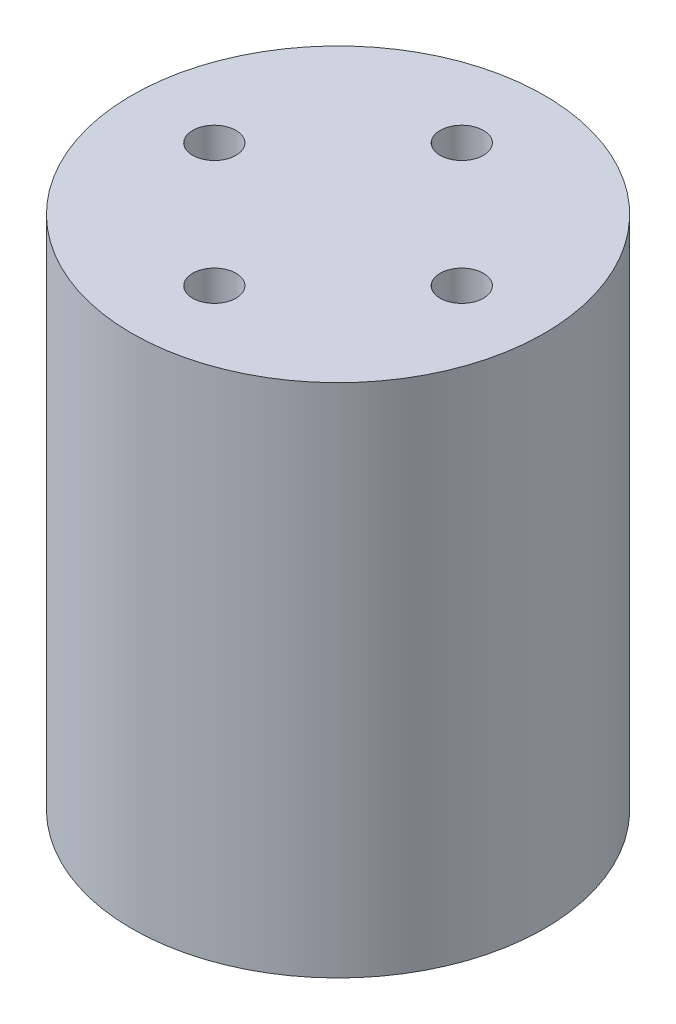
ISO-10303-21;
HEADER;
FILE_DESCRIPTION(('STEP AP214'),'2;1');
FILE_NAME('part.step','',(''),(''),'','','');
FILE_SCHEMA(('AUTOMOTIVE_DESIGN { 1 0 10303 214 1 1 1 1 }'));
ENDSEC;
DATA;
#1=APPLICATION_CONTEXT('core data for automotive mechanical design processes');
#2=APPLICATION_PROTOCOL_DEFINITION('international standard','automotive_design',2000,#1);
#3=PRODUCT_CONTEXT('',#1,'mechanical');
#4=PRODUCT('Part','Part','',(#3));
#5=PRODUCT_RELATED_PRODUCT_CATEGORY('part','',(#4));
#6=PRODUCT_DEFINITION_FORMATION('','',#4);
#7=PRODUCT_DEFINITION_CONTEXT('part definition',#1,'design');
#8=PRODUCT_DEFINITION('design','',#6,#7);
#9=PRODUCT_DEFINITION_SHAPE('','',#8);
#10=(LENGTH_UNIT() NAMED_UNIT(*) SI_UNIT(.MILLI.,.METRE.));
#11=(NAMED_UNIT(*) PLANE_ANGLE_UNIT() SI_UNIT($,.RADIAN.));
#12=(NAMED_UNIT(*) SI_UNIT($,.STERADIAN.) SOLID_ANGLE_UNIT());
#13=UNCERTAINTY_MEASURE_WITH_UNIT(LENGTH_MEASURE(1.E-05),#10,'distance_accuracy_value','');
#14=(GEOMETRIC_REPRESENTATION_CONTEXT(3) GLOBAL_UNCERTAINTY_ASSIGNED_CONTEXT((#13)) GLOBAL_UNIT_ASSIGNED_CONTEXT((#10,
#11,#12)) REPRESENTATION_CONTEXT('',''));
#15=CARTESIAN_POINT('',(0.,0.,0.));
#16=DIRECTION('',(0.,0.,1.));
#17=DIRECTION('',(1.,0.,0.));
#18=AXIS2_PLACEMENT_3D('',#15,#16,#17);
#19=CARTESIAN_POINT('',(0.,25.,0.));
#20=DIRECTION('',(0.,-1.,0.));
#21=DIRECTION('',(0.,0.,-1.));
#22=AXIS2_PLACEMENT_3D('',#19,#20,#21);
#23=CYLINDRICAL_SURFACE('',#22,20.);
#24=CARTESIAN_POINT('',(0.,25.,0.));
#25=DIRECTION('',(0.,1.,0.));
#26=DIRECTION('',(0.,0.,1.));
#27=AXIS2_PLACEMENT_3D('',#24,#25,#26);
#28=CIRCLE('',#27,20.);
#29=CARTESIAN_POINT('',(0.,25.,20.));
#30=VERTEX_POINT('',#29);
#31=EDGE_CURVE('E11',#30,#30,#28,.T.);
#32=ORIENTED_EDGE('',*,*,#31,.F.);
#33=EDGE_LOOP('',(#32));
#34=FACE_BOUND('',#33,.T.);
#35=CARTESIAN_POINT('',(0.,-25.,0.));
#36=DIRECTION('',(0.,1.,0.));
#37=DIRECTION('',(0.,0.,1.));
#38=AXIS2_PLACEMENT_3D('',#35,#36,#37);
#39=CIRCLE('',#38,20.);
#40=CARTESIAN_POINT('',(0.,-25.,20.));
#41=VERTEX_POINT('',#40);
#42=EDGE_CURVE('E50',#41,#41,#39,.T.);
#43=ORIENTED_EDGE('',*,*,#42,.T.);
#44=EDGE_LOOP('',(#43));
#45=FACE_BOUND('',#44,.T.);
#46=ADVANCED_FACE('F47',(#34,#45),#23,.T.);
#47=CARTESIAN_POINT('',(0.,25.,0.));
#48=DIRECTION('',(0.,1.,0.));
#49=DIRECTION('',(0.,0.,1.));
#50=AXIS2_PLACEMENT_3D('',#47,#48,#49);
#51=PLANE('',#50);
#52=CARTESIAN_POINT('',(0.,25.,-12.));
#53=DIRECTION('',(0.,1.,0.));
#54=DIRECTION('',(0.,0.,1.));
#55=AXIS2_PLACEMENT_3D('',#52,#53,#54);
#56=CIRCLE('',#55,2.1);
#57=CARTESIAN_POINT('',(0.,25.,-9.9));
#58=VERTEX_POINT('',#57);
#59=EDGE_CURVE('E80',#58,#58,#56,.T.);
#60=ORIENTED_EDGE('',*,*,#59,.F.);
#61=EDGE_LOOP('',(#60));
#62=FACE_BOUND('',#61,.T.);
#63=CARTESIAN_POINT('',(12.,25.,0.));
#64=DIRECTION('',(0.,1.,0.));
#65=DIRECTION('',(0.,0.,1.));
#66=AXIS2_PLACEMENT_3D('',#63,#64,#65);
#67=CIRCLE('',#66,2.1);
#68=CARTESIAN_POINT('',(12.,25.,2.1));
#69=VERTEX_POINT('',#68);
#70=EDGE_CURVE('E79',#69,#69,#67,.T.);
#71=ORIENTED_EDGE('',*,*,#70,.F.);
#72=EDGE_LOOP('',(#71));
#73=FACE_BOUND('',#72,.T.);
#74=CARTESIAN_POINT('',(0.,25.,12.));
#75=DIRECTION('',(0.,1.,0.));
#76=DIRECTION('',(0.,0.,1.));
#77=AXIS2_PLACEMENT_3D('',#74,#75,#76);
#78=CIRCLE('',#77,2.1);
#79=CARTESIAN_POINT('',(0.,25.,14.1));
#80=VERTEX_POINT('',#79);
#81=EDGE_CURVE('E93',#80,#80,#78,.T.);
#82=ORIENTED_EDGE('',*,*,#81,.F.);
#83=EDGE_LOOP('',(#82));
#84=FACE_BOUND('',#83,.T.);
#85=CARTESIAN_POINT('',(-12.,25.,0.));
#86=DIRECTION('',(0.,1.,0.));
#87=DIRECTION('',(0.,0.,1.));
#88=AXIS2_PLACEMENT_3D('',#85,#86,#87);
#89=CIRCLE('',#88,2.1);
#90=CARTESIAN_POINT('',(-12.,25.,2.1));
#91=VERTEX_POINT('',#90);
#92=EDGE_CURVE('E101',#91,#91,#89,.T.);
#93=ORIENTED_EDGE('',*,*,#92,.F.);
#94=EDGE_LOOP('',(#93));
#95=FACE_BOUND('',#94,.T.);
#96=ORIENTED_EDGE('',*,*,#31,.T.);
#97=EDGE_LOOP('',(#96));
#98=FACE_BOUND('',#97,.T.);
#99=ADVANCED_FACE('F118',(#62,#73,#84,#95,#98),#51,.T.);
#100=CARTESIAN_POINT('',(0.,-25.,0.));
#101=DIRECTION('',(0.,1.,0.));
#102=DIRECTION('',(0.,0.,1.));
#103=AXIS2_PLACEMENT_3D('',#100,#101,#102);
#104=PLANE('',#103);
#105=ORIENTED_EDGE('',*,*,#42,.F.);
#106=EDGE_LOOP('',(#105));
#107=FACE_BOUND('',#106,.T.);
#108=ADVANCED_FACE('F115',(#107),#104,.F.);
#109=CARTESIAN_POINT('',(-12.,6.26180729995787,0.));
#110=DIRECTION('',(0.,1.,0.));
#111=DIRECTION('',(0.,0.,1.));
#112=AXIS2_PLACEMENT_3D('',#109,#110,#111);
#113=CONICAL_SURFACE('',#112,2.1,1.02974425867665);
#114=CARTESIAN_POINT('',(-12.,5.,0.));
#115=VERTEX_POINT('',#114);
#116=VERTEX_LOOP('',#115);
#117=FACE_BOUND('',#116,.T.);
#118=CARTESIAN_POINT('',(-12.,6.26180729995787,0.));
#119=DIRECTION('',(0.,1.,0.));
#120=DIRECTION('',(0.,0.,1.));
#121=AXIS2_PLACEMENT_3D('',#118,#119,#120);
#122=CIRCLE('',#121,2.1);
#123=CARTESIAN_POINT('',(-12.,6.26180729995787,2.1));
#124=VERTEX_POINT('',#123);
#125=EDGE_CURVE('E105',#124,#124,#122,.T.);
#126=ORIENTED_EDGE('',*,*,#125,.T.);
#127=EDGE_LOOP('',(#126));
#128=FACE_BOUND('',#127,.T.);
#129=ADVANCED_FACE('F117',(#117,#128),#113,.F.);
#130=CARTESIAN_POINT('',(-12.,25.,0.));
#131=DIRECTION('',(0.,1.,0.));
#132=DIRECTION('',(0.,0.,1.));
#133=AXIS2_PLACEMENT_3D('',#130,#131,#132);
#134=CYLINDRICAL_SURFACE('',#133,2.1);
#135=ORIENTED_EDGE('',*,*,#125,.F.);
#136=EDGE_LOOP('',(#135));
#137=FACE_BOUND('',#136,.T.);
#138=ORIENTED_EDGE('',*,*,#92,.T.);
#139=EDGE_LOOP('',(#138));
#140=FACE_BOUND('',#139,.T.);
#141=ADVANCED_FACE('F123',(#137,#140),#134,.F.);
#142=CARTESIAN_POINT('',(0.,6.26180729995787,12.));
#143=DIRECTION('',(0.,1.,0.));
#144=DIRECTION('',(0.,0.,1.));
#145=AXIS2_PLACEMENT_3D('',#142,#143,#144);
#146=CONICAL_SURFACE('',#145,2.1,1.02974425867665);
#147=CARTESIAN_POINT('',(0.,5.,12.));
#148=VERTEX_POINT('',#147);
#149=VERTEX_LOOP('',#148);
#150=FACE_BOUND('',#149,.T.);
#151=CARTESIAN_POINT('',(0.,6.26180729995787,12.));
#152=DIRECTION('',(0.,1.,0.));
#153=DIRECTION('',(0.,0.,1.));
#154=AXIS2_PLACEMENT_3D('',#151,#152,#153);
#155=CIRCLE('',#154,2.1);
#156=CARTESIAN_POINT('',(0.,6.26180729995787,14.1));
#157=VERTEX_POINT('',#156);
#158=EDGE_CURVE('E97',#157,#157,#155,.T.);
#159=ORIENTED_EDGE('',*,*,#158,.T.);
#160=EDGE_LOOP('',(#159));
#161=FACE_BOUND('',#160,.T.);
#162=ADVANCED_FACE('F176',(#150,#161),#146,.F.);
#163=CARTESIAN_POINT('',(0.,25.,12.));
#164=DIRECTION('',(0.,1.,0.));
#165=DIRECTION('',(0.,0.,1.));
#166=AXIS2_PLACEMENT_3D('',#163,#164,#165);
#167=CYLINDRICAL_SURFACE('',#166,2.1);
#168=ORIENTED_EDGE('',*,*,#158,.F.);
#169=EDGE_LOOP('',(#168));
#170=FACE_BOUND('',#169,.T.);
#171=ORIENTED_EDGE('',*,*,#81,.T.);
#172=EDGE_LOOP('',(#171));
#173=FACE_BOUND('',#172,.T.);
#174=ADVANCED_FACE('F167',(#170,#173),#167,.F.);
#175=CARTESIAN_POINT('',(12.,6.26180729995787,0.));
#176=DIRECTION('',(0.,1.,0.));
#177=DIRECTION('',(0.,0.,1.));
#178=AXIS2_PLACEMENT_3D('',#175,#176,#177);
#179=CONICAL_SURFACE('',#178,2.1,1.02974425867665);
#180=CARTESIAN_POINT('',(12.,5.,0.));
#181=VERTEX_POINT('',#180);
#182=VERTEX_LOOP('',#181);
#183=FACE_BOUND('',#182,.T.);
#184=CARTESIAN_POINT('',(12.,6.26180729995787,0.));
#185=DIRECTION('',(0.,1.,0.));
#186=DIRECTION('',(0.,0.,1.));
#187=AXIS2_PLACEMENT_3D('',#184,#185,#186);
#188=CIRCLE('',#187,2.1);
#189=CARTESIAN_POINT('',(12.,6.26180729995787,2.1));
#190=VERTEX_POINT('',#189);
#191=EDGE_CURVE('E85',#190,#190,#188,.T.);
#192=ORIENTED_EDGE('',*,*,#191,.T.);
#193=EDGE_LOOP('',(#192));
#194=FACE_BOUND('',#193,.T.);
#195=ADVANCED_FACE('F160',(#183,#194),#179,.F.);
#196=CARTESIAN_POINT('',(12.,25.,0.));
#197=DIRECTION('',(0.,1.,0.));
#198=DIRECTION('',(0.,0.,1.));
#199=AXIS2_PLACEMENT_3D('',#196,#197,#198);
#200=CYLINDRICAL_SURFACE('',#199,2.1);
#201=ORIENTED_EDGE('',*,*,#191,.F.);
#202=EDGE_LOOP('',(#201));
#203=FACE_BOUND('',#202,.T.);
#204=ORIENTED_EDGE('',*,*,#70,.T.);
#205=EDGE_LOOP('',(#204));
#206=FACE_BOUND('',#205,.T.);
#207=ADVANCED_FACE('F72',(#203,#206),#200,.F.);
#208=CARTESIAN_POINT('',(0.,6.26180729995787,-12.));
#209=DIRECTION('',(0.,1.,0.));
#210=DIRECTION('',(0.,0.,1.));
#211=AXIS2_PLACEMENT_3D('',#208,#209,#210);
#212=CONICAL_SURFACE('',#211,2.1,1.02974425867665);
#213=CARTESIAN_POINT('',(0.,5.,-12.));
#214=VERTEX_POINT('',#213);
#215=VERTEX_LOOP('',#214);
#216=FACE_BOUND('',#215,.T.);
#217=CARTESIAN_POINT('',(0.,6.26180729995787,-12.));
#218=DIRECTION('',(0.,1.,0.));
#219=DIRECTION('',(0.,0.,1.));
#220=AXIS2_PLACEMENT_3D('',#217,#218,#219);
#221=CIRCLE('',#220,2.1);
#222=CARTESIAN_POINT('',(0.,6.26180729995787,-9.90000000000001));
#223=VERTEX_POINT('',#222);
#224=EDGE_CURVE('E76',#223,#223,#221,.T.);
#225=ORIENTED_EDGE('',*,*,#224,.T.);
#226=EDGE_LOOP('',(#225));
#227=FACE_BOUND('',#226,.T.);
#228=ADVANCED_FACE('F68',(#216,#227),#212,.F.);
#229=CARTESIAN_POINT('',(0.,25.,-12.));
#230=DIRECTION('',(0.,1.,0.));
#231=DIRECTION('',(0.,0.,1.));
#232=AXIS2_PLACEMENT_3D('',#229,#230,#231);
#233=CYLINDRICAL_SURFACE('',#232,2.1);
#234=ORIENTED_EDGE('',*,*,#224,.F.);
#235=EDGE_LOOP('',(#234));
#236=FACE_BOUND('',#235,.T.);
#237=ORIENTED_EDGE('',*,*,#59,.T.);
#238=EDGE_LOOP('',(#237));
#239=FACE_BOUND('',#238,.T.);
#240=ADVANCED_FACE('F71',(#236,#239),#233,.F.);
#241=CLOSED_SHELL('',(#46,#99,#108,#129,#141,#162,#174,#195,#207,#228,#240));
#242=MANIFOLD_SOLID_BREP('B2',#241);
#243=ADVANCED_BREP_SHAPE_REPRESENTATION('',(#18,#242),#14);
#244=SHAPE_DEFINITION_REPRESENTATION(#9,#243);
ENDSEC;
END-ISO-10303-21;
